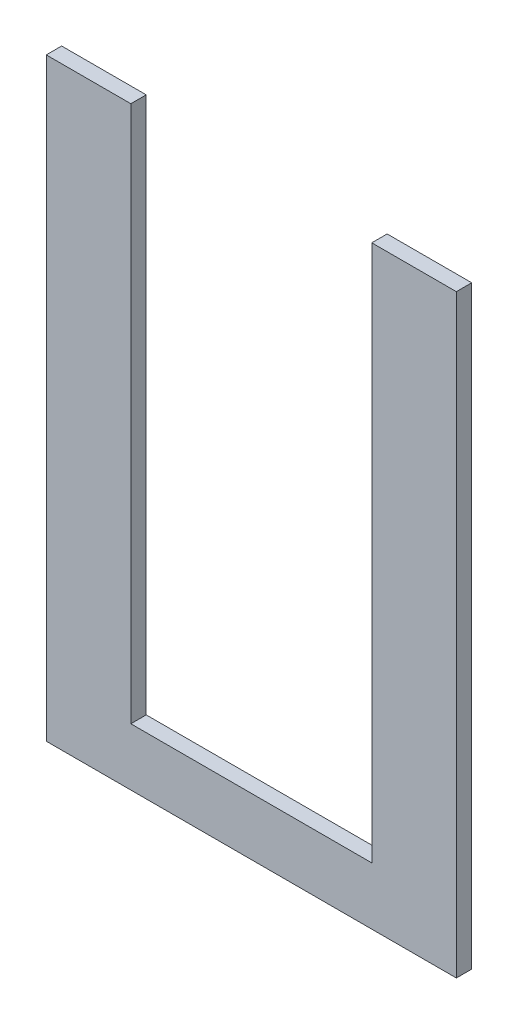
ISO-10303-21;
HEADER;
FILE_DESCRIPTION(('STEP AP214'),'2;1');
FILE_NAME('part.step','',(''),(''),'','','');
FILE_SCHEMA(('AUTOMOTIVE_DESIGN { 1 0 10303 214 1 1 1 1 }'));
ENDSEC;
DATA;
#1=APPLICATION_CONTEXT('core data for automotive mechanical design processes');
#2=APPLICATION_PROTOCOL_DEFINITION('international standard','automotive_design',2000,#1);
#3=PRODUCT_CONTEXT('',#1,'mechanical');
#4=PRODUCT('Part','Part','',(#3));
#5=PRODUCT_RELATED_PRODUCT_CATEGORY('part','',(#4));
#6=PRODUCT_DEFINITION_FORMATION('','',#4);
#7=PRODUCT_DEFINITION_CONTEXT('part definition',#1,'design');
#8=PRODUCT_DEFINITION('design','',#6,#7);
#9=PRODUCT_DEFINITION_SHAPE('','',#8);
#10=(LENGTH_UNIT() NAMED_UNIT(*) SI_UNIT(.MILLI.,.METRE.));
#11=(NAMED_UNIT(*) PLANE_ANGLE_UNIT() SI_UNIT($,.RADIAN.));
#12=(NAMED_UNIT(*) SI_UNIT($,.STERADIAN.) SOLID_ANGLE_UNIT());
#13=UNCERTAINTY_MEASURE_WITH_UNIT(LENGTH_MEASURE(1.E-05),#10,'distance_accuracy_value','');
#14=(GEOMETRIC_REPRESENTATION_CONTEXT(3) GLOBAL_UNCERTAINTY_ASSIGNED_CONTEXT((#13)) GLOBAL_UNIT_ASSIGNED_CONTEXT((#10,
#11,#12)) REPRESENTATION_CONTEXT('',''));
#15=CARTESIAN_POINT('',(0.,0.,0.));
#16=DIRECTION('',(0.,0.,1.));
#17=DIRECTION('',(1.,0.,0.));
#18=AXIS2_PLACEMENT_3D('',#15,#16,#17);
#19=CARTESIAN_POINT('',(0.,0.,-3.));
#20=DIRECTION('',(-1.,0.,0.));
#21=DIRECTION('',(0.,0.,1.));
#22=AXIS2_PLACEMENT_3D('',#19,#20,#21);
#23=PLANE('',#22);
#24=DIRECTION('',(0.,-1.,0.));
#25=VECTOR('',#24,1.);
#26=CARTESIAN_POINT('',(0.,0.,0.));
#27=LINE('',#26,#25);
#28=CARTESIAN_POINT('',(0.,115.957009142378,0.));
#29=VERTEX_POINT('',#28);
#30=CARTESIAN_POINT('',(0.,0.,0.));
#31=VERTEX_POINT('',#30);
#32=EDGE_CURVE('E130',#29,#31,#27,.T.);
#33=ORIENTED_EDGE('',*,*,#32,.F.);
#34=DIRECTION('',(0.,0.,1.));
#35=VECTOR('',#34,1.);
#36=CARTESIAN_POINT('',(0.,115.957009142378,-3.));
#37=LINE('',#36,#35);
#38=CARTESIAN_POINT('',(0.,115.957009142378,-3.));
#39=VERTEX_POINT('',#38);
#40=EDGE_CURVE('E11',#39,#29,#37,.T.);
#41=ORIENTED_EDGE('',*,*,#40,.F.);
#42=DIRECTION('',(0.,-1.,0.));
#43=VECTOR('',#42,1.);
#44=CARTESIAN_POINT('',(0.,0.,-3.));
#45=LINE('',#44,#43);
#46=CARTESIAN_POINT('',(0.,0.,-3.));
#47=VERTEX_POINT('',#46);
#48=EDGE_CURVE('E150',#39,#47,#45,.T.);
#49=ORIENTED_EDGE('',*,*,#48,.T.);
#50=DIRECTION('',(0.,0.,1.));
#51=VECTOR('',#50,1.);
#52=CARTESIAN_POINT('',(0.,0.,-3.));
#53=LINE('',#52,#51);
#54=EDGE_CURVE('E36',#47,#31,#53,.T.);
#55=ORIENTED_EDGE('',*,*,#54,.T.);
#56=EDGE_LOOP('',(#33,#41,#49,#55));
#57=FACE_BOUND('',#56,.T.);
#58=ADVANCED_FACE('F33',(#57),#23,.T.);
#59=CARTESIAN_POINT('',(16.5,115.957009142378,-3.));
#60=DIRECTION('',(0.,1.,0.));
#61=DIRECTION('',(0.,0.,1.));
#62=AXIS2_PLACEMENT_3D('',#59,#60,#61);
#63=PLANE('',#62);
#64=DIRECTION('',(-1.,0.,0.));
#65=VECTOR('',#64,1.);
#66=CARTESIAN_POINT('',(16.5,115.957009142378,0.));
#67=LINE('',#66,#65);
#68=CARTESIAN_POINT('',(16.5,115.957009142378,0.));
#69=VERTEX_POINT('',#68);
#70=EDGE_CURVE('E148',#69,#29,#67,.T.);
#71=ORIENTED_EDGE('',*,*,#70,.F.);
#72=DIRECTION('',(0.,0.,1.));
#73=VECTOR('',#72,1.);
#74=CARTESIAN_POINT('',(16.5,115.957009142378,-3.));
#75=LINE('',#74,#73);
#76=CARTESIAN_POINT('',(16.5,115.957009142378,-3.));
#77=VERTEX_POINT('',#76);
#78=EDGE_CURVE('E42',#77,#69,#75,.T.);
#79=ORIENTED_EDGE('',*,*,#78,.F.);
#80=DIRECTION('',(-1.,0.,0.));
#81=VECTOR('',#80,1.);
#82=CARTESIAN_POINT('',(16.5,115.957009142378,-3.));
#83=LINE('',#82,#81);
#84=EDGE_CURVE('E120',#77,#39,#83,.T.);
#85=ORIENTED_EDGE('',*,*,#84,.T.);
#86=ORIENTED_EDGE('',*,*,#40,.T.);
#87=EDGE_LOOP('',(#71,#79,#85,#86));
#88=FACE_BOUND('',#87,.T.);
#89=ADVANCED_FACE('F162',(#88),#63,.T.);
#90=CARTESIAN_POINT('',(16.5,115.957009142378,-3.));
#91=DIRECTION('',(1.,0.,0.));
#92=DIRECTION('',(0.,1.,0.));
#93=AXIS2_PLACEMENT_3D('',#90,#91,#92);
#94=PLANE('',#93);
#95=DIRECTION('',(0.,1.,0.));
#96=VECTOR('',#95,1.);
#97=CARTESIAN_POINT('',(16.5,115.957009142378,0.));
#98=LINE('',#97,#96);
#99=CARTESIAN_POINT('',(16.5,11.2,0.));
#100=VERTEX_POINT('',#99);
#101=EDGE_CURVE('E107',#100,#69,#98,.T.);
#102=ORIENTED_EDGE('',*,*,#101,.F.);
#103=DIRECTION('',(0.,0.,1.));
#104=VECTOR('',#103,1.);
#105=CARTESIAN_POINT('',(16.5,11.2,-3.));
#106=LINE('',#105,#104);
#107=CARTESIAN_POINT('',(16.5,11.2,-3.));
#108=VERTEX_POINT('',#107);
#109=EDGE_CURVE('E102',#108,#100,#106,.T.);
#110=ORIENTED_EDGE('',*,*,#109,.F.);
#111=DIRECTION('',(0.,1.,0.));
#112=VECTOR('',#111,1.);
#113=CARTESIAN_POINT('',(16.5,115.957009142378,-3.));
#114=LINE('',#113,#112);
#115=EDGE_CURVE('E105',#108,#77,#114,.T.);
#116=ORIENTED_EDGE('',*,*,#115,.T.);
#117=ORIENTED_EDGE('',*,*,#78,.T.);
#118=EDGE_LOOP('',(#102,#110,#116,#117));
#119=FACE_BOUND('',#118,.T.);
#120=ADVANCED_FACE('F104',(#119),#94,.T.);
#121=CARTESIAN_POINT('',(16.5,11.2,-3.));
#122=DIRECTION('',(0.,1.,0.));
#123=DIRECTION('',(-1.,0.,0.));
#124=AXIS2_PLACEMENT_3D('',#121,#122,#123);
#125=PLANE('',#124);
#126=DIRECTION('',(-1.,0.,0.));
#127=VECTOR('',#126,1.);
#128=CARTESIAN_POINT('',(16.5,11.2,0.));
#129=LINE('',#128,#127);
#130=CARTESIAN_POINT('',(63.5000000000001,11.2,0.));
#131=VERTEX_POINT('',#130);
#132=EDGE_CURVE('E145',#131,#100,#129,.T.);
#133=ORIENTED_EDGE('',*,*,#132,.F.);
#134=DIRECTION('',(0.,0.,1.));
#135=VECTOR('',#134,1.);
#136=CARTESIAN_POINT('',(63.5000000000001,11.2,-3.));
#137=LINE('',#136,#135);
#138=CARTESIAN_POINT('',(63.5000000000001,11.2,-3.));
#139=VERTEX_POINT('',#138);
#140=EDGE_CURVE('E112',#139,#131,#137,.T.);
#141=ORIENTED_EDGE('',*,*,#140,.F.);
#142=DIRECTION('',(-1.,0.,0.));
#143=VECTOR('',#142,1.);
#144=CARTESIAN_POINT('',(16.5,11.2,-3.));
#145=LINE('',#144,#143);
#146=EDGE_CURVE('E118',#139,#108,#145,.T.);
#147=ORIENTED_EDGE('',*,*,#146,.T.);
#148=ORIENTED_EDGE('',*,*,#109,.T.);
#149=EDGE_LOOP('',(#133,#141,#147,#148));
#150=FACE_BOUND('',#149,.T.);
#151=ADVANCED_FACE('F122',(#150),#125,.T.);
#152=CARTESIAN_POINT('',(63.5000000000001,11.2,-3.));
#153=DIRECTION('',(-1.,0.,0.));
#154=DIRECTION('',(0.,-1.,0.));
#155=AXIS2_PLACEMENT_3D('',#152,#153,#154);
#156=PLANE('',#155);
#157=DIRECTION('',(0.,-1.,0.));
#158=VECTOR('',#157,1.);
#159=CARTESIAN_POINT('',(63.5000000000001,11.2,0.));
#160=LINE('',#159,#158);
#161=CARTESIAN_POINT('',(63.5,115.957009142378,0.));
#162=VERTEX_POINT('',#161);
#163=EDGE_CURVE('E142',#162,#131,#160,.T.);
#164=ORIENTED_EDGE('',*,*,#163,.F.);
#165=DIRECTION('',(0.,0.,1.));
#166=VECTOR('',#165,1.);
#167=CARTESIAN_POINT('',(63.5,115.957009142378,-3.));
#168=LINE('',#167,#166);
#169=CARTESIAN_POINT('',(63.5,115.957009142378,-3.));
#170=VERTEX_POINT('',#169);
#171=EDGE_CURVE('E154',#170,#162,#168,.T.);
#172=ORIENTED_EDGE('',*,*,#171,.F.);
#173=DIRECTION('',(0.,-1.,0.));
#174=VECTOR('',#173,1.);
#175=CARTESIAN_POINT('',(63.5000000000001,11.2,-3.));
#176=LINE('',#175,#174);
#177=EDGE_CURVE('E123',#170,#139,#176,.T.);
#178=ORIENTED_EDGE('',*,*,#177,.T.);
#179=ORIENTED_EDGE('',*,*,#140,.T.);
#180=EDGE_LOOP('',(#164,#172,#178,#179));
#181=FACE_BOUND('',#180,.T.);
#182=ADVANCED_FACE('F175',(#181),#156,.T.);
#183=CARTESIAN_POINT('',(63.5,115.957009142378,-3.));
#184=DIRECTION('',(0.,1.,0.));
#185=DIRECTION('',(0.,0.,1.));
#186=AXIS2_PLACEMENT_3D('',#183,#184,#185);
#187=PLANE('',#186);
#188=DIRECTION('',(-1.,0.,0.));
#189=VECTOR('',#188,1.);
#190=CARTESIAN_POINT('',(63.5,115.957009142378,0.));
#191=LINE('',#190,#189);
#192=CARTESIAN_POINT('',(80.,115.957009142378,0.));
#193=VERTEX_POINT('',#192);
#194=EDGE_CURVE('E139',#193,#162,#191,.T.);
#195=ORIENTED_EDGE('',*,*,#194,.F.);
#196=DIRECTION('',(0.,0.,1.));
#197=VECTOR('',#196,1.);
#198=CARTESIAN_POINT('',(80.,115.957009142378,-3.));
#199=LINE('',#198,#197);
#200=CARTESIAN_POINT('',(80.,115.957009142378,-3.));
#201=VERTEX_POINT('',#200);
#202=EDGE_CURVE('E156',#201,#193,#199,.T.);
#203=ORIENTED_EDGE('',*,*,#202,.F.);
#204=DIRECTION('',(-1.,0.,0.));
#205=VECTOR('',#204,1.);
#206=CARTESIAN_POINT('',(63.5,115.957009142378,-3.));
#207=LINE('',#206,#205);
#208=EDGE_CURVE('E125',#201,#170,#207,.T.);
#209=ORIENTED_EDGE('',*,*,#208,.T.);
#210=ORIENTED_EDGE('',*,*,#171,.T.);
#211=EDGE_LOOP('',(#195,#203,#209,#210));
#212=FACE_BOUND('',#211,.T.);
#213=ADVANCED_FACE('F178',(#212),#187,.T.);
#214=CARTESIAN_POINT('',(80.,0.,-3.));
#215=DIRECTION('',(1.,0.,0.));
#216=DIRECTION('',(0.,0.,-1.));
#217=AXIS2_PLACEMENT_3D('',#214,#215,#216);
#218=PLANE('',#217);
#219=DIRECTION('',(0.,1.,0.));
#220=VECTOR('',#219,1.);
#221=CARTESIAN_POINT('',(80.,0.,0.));
#222=LINE('',#221,#220);
#223=CARTESIAN_POINT('',(80.,0.,0.));
#224=VERTEX_POINT('',#223);
#225=EDGE_CURVE('E136',#224,#193,#222,.T.);
#226=ORIENTED_EDGE('',*,*,#225,.F.);
#227=DIRECTION('',(0.,0.,1.));
#228=VECTOR('',#227,1.);
#229=CARTESIAN_POINT('',(80.,0.,-3.));
#230=LINE('',#229,#228);
#231=CARTESIAN_POINT('',(80.,0.,-3.));
#232=VERTEX_POINT('',#231);
#233=EDGE_CURVE('E157',#232,#224,#230,.T.);
#234=ORIENTED_EDGE('',*,*,#233,.F.);
#235=DIRECTION('',(0.,1.,0.));
#236=VECTOR('',#235,1.);
#237=CARTESIAN_POINT('',(80.,0.,-3.));
#238=LINE('',#237,#236);
#239=EDGE_CURVE('E253',#232,#201,#238,.T.);
#240=ORIENTED_EDGE('',*,*,#239,.T.);
#241=ORIENTED_EDGE('',*,*,#202,.T.);
#242=EDGE_LOOP('',(#226,#234,#240,#241));
#243=FACE_BOUND('',#242,.T.);
#244=ADVANCED_FACE('F182',(#243),#218,.T.);
#245=CARTESIAN_POINT('',(0.,0.,-3.));
#246=DIRECTION('',(0.,-1.,0.));
#247=DIRECTION('',(0.,0.,-1.));
#248=AXIS2_PLACEMENT_3D('',#245,#246,#247);
#249=PLANE('',#248);
#250=DIRECTION('',(1.,0.,0.));
#251=VECTOR('',#250,1.);
#252=CARTESIAN_POINT('',(0.,0.,0.));
#253=LINE('',#252,#251);
#254=EDGE_CURVE('E133',#31,#224,#253,.T.);
#255=ORIENTED_EDGE('',*,*,#254,.F.);
#256=ORIENTED_EDGE('',*,*,#54,.F.);
#257=DIRECTION('',(1.,0.,0.));
#258=VECTOR('',#257,1.);
#259=CARTESIAN_POINT('',(0.,0.,-3.));
#260=LINE('',#259,#258);
#261=EDGE_CURVE('E254',#47,#232,#260,.T.);
#262=ORIENTED_EDGE('',*,*,#261,.T.);
#263=ORIENTED_EDGE('',*,*,#233,.T.);
#264=EDGE_LOOP('',(#255,#256,#262,#263));
#265=FACE_BOUND('',#264,.T.);
#266=ADVANCED_FACE('F159',(#265),#249,.T.);
#267=CARTESIAN_POINT('',(0.,0.,-3.));
#268=DIRECTION('',(0.,0.,1.));
#269=DIRECTION('',(1.,0.,0.));
#270=AXIS2_PLACEMENT_3D('',#267,#268,#269);
#271=PLANE('',#270);
#272=ORIENTED_EDGE('',*,*,#48,.F.);
#273=ORIENTED_EDGE('',*,*,#84,.F.);
#274=ORIENTED_EDGE('',*,*,#115,.F.);
#275=ORIENTED_EDGE('',*,*,#146,.F.);
#276=ORIENTED_EDGE('',*,*,#177,.F.);
#277=ORIENTED_EDGE('',*,*,#208,.F.);
#278=ORIENTED_EDGE('',*,*,#239,.F.);
#279=ORIENTED_EDGE('',*,*,#261,.F.);
#280=EDGE_LOOP('',(#272,#273,#274,#275,#276,#277,#278,#279));
#281=FACE_BOUND('',#280,.T.);
#282=ADVANCED_FACE('F116',(#281),#271,.F.);
#283=CARTESIAN_POINT('',(0.,0.,0.));
#284=DIRECTION('',(0.,0.,1.));
#285=DIRECTION('',(1.,0.,0.));
#286=AXIS2_PLACEMENT_3D('',#283,#284,#285);
#287=PLANE('',#286);
#288=ORIENTED_EDGE('',*,*,#32,.T.);
#289=ORIENTED_EDGE('',*,*,#254,.T.);
#290=ORIENTED_EDGE('',*,*,#225,.T.);
#291=ORIENTED_EDGE('',*,*,#194,.T.);
#292=ORIENTED_EDGE('',*,*,#163,.T.);
#293=ORIENTED_EDGE('',*,*,#132,.T.);
#294=ORIENTED_EDGE('',*,*,#101,.T.);
#295=ORIENTED_EDGE('',*,*,#70,.T.);
#296=EDGE_LOOP('',(#288,#289,#290,#291,#292,#293,#294,#295));
#297=FACE_BOUND('',#296,.T.);
#298=ADVANCED_FACE('F161',(#297),#287,.T.);
#299=CLOSED_SHELL('',(#58,#89,#120,#151,#182,#213,#244,#266,#282,#298));
#300=MANIFOLD_SOLID_BREP('B2',#299);
#301=ADVANCED_BREP_SHAPE_REPRESENTATION('',(#18,#300),#14);
#302=SHAPE_DEFINITION_REPRESENTATION(#9,#301);
ENDSEC;
END-ISO-10303-21;
